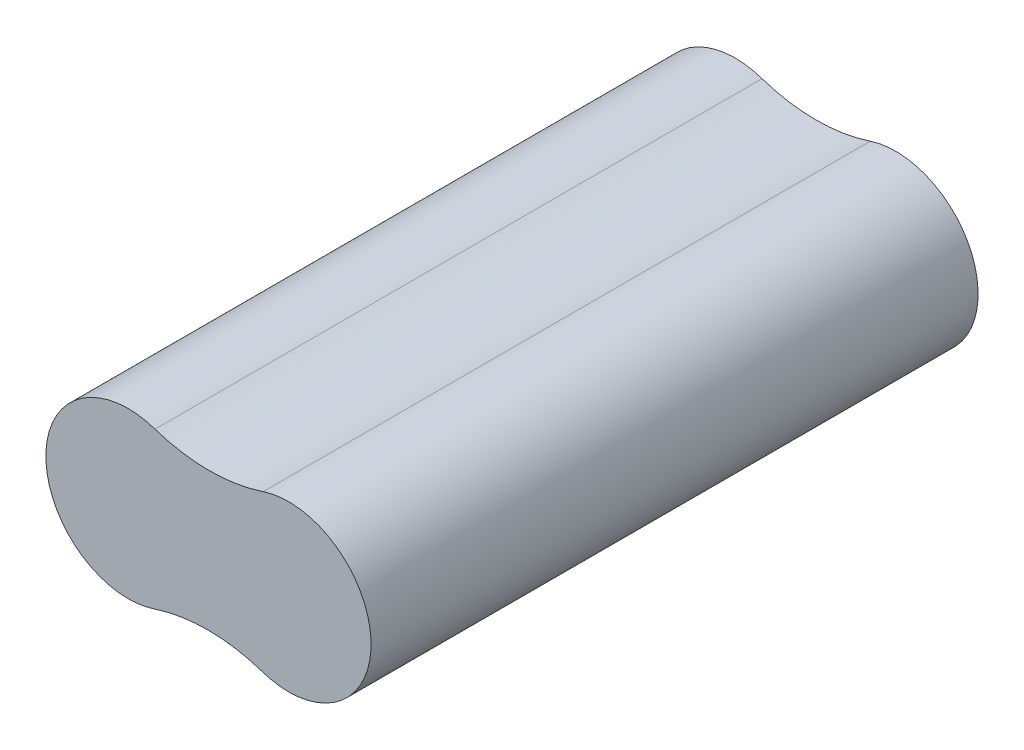
ISO-10303-21;
HEADER;
FILE_DESCRIPTION(('STEP AP214'),'2;1');
FILE_NAME('part.step','',(''),(''),'','','');
FILE_SCHEMA(('AUTOMOTIVE_DESIGN { 1 0 10303 214 1 1 1 1 }'));
ENDSEC;
DATA;
#1=APPLICATION_CONTEXT('core data for automotive mechanical design processes');
#2=APPLICATION_PROTOCOL_DEFINITION('international standard','automotive_design',2000,#1);
#3=PRODUCT_CONTEXT('',#1,'mechanical');
#4=PRODUCT('Part','Part','',(#3));
#5=PRODUCT_RELATED_PRODUCT_CATEGORY('part','',(#4));
#6=PRODUCT_DEFINITION_FORMATION('','',#4);
#7=PRODUCT_DEFINITION_CONTEXT('part definition',#1,'design');
#8=PRODUCT_DEFINITION('design','',#6,#7);
#9=PRODUCT_DEFINITION_SHAPE('','',#8);
#10=(LENGTH_UNIT() NAMED_UNIT(*) SI_UNIT(.MILLI.,.METRE.));
#11=(NAMED_UNIT(*) PLANE_ANGLE_UNIT() SI_UNIT($,.RADIAN.));
#12=(NAMED_UNIT(*) SI_UNIT($,.STERADIAN.) SOLID_ANGLE_UNIT());
#13=UNCERTAINTY_MEASURE_WITH_UNIT(LENGTH_MEASURE(1.E-05),#10,'distance_accuracy_value','');
#14=(GEOMETRIC_REPRESENTATION_CONTEXT(3) GLOBAL_UNCERTAINTY_ASSIGNED_CONTEXT((#13)) GLOBAL_UNIT_ASSIGNED_CONTEXT((#10,
#11,#12)) REPRESENTATION_CONTEXT('',''));
#15=CARTESIAN_POINT('',(0.,0.,0.));
#16=DIRECTION('',(0.,0.,1.));
#17=DIRECTION('',(1.,0.,0.));
#18=AXIS2_PLACEMENT_3D('',#15,#16,#17);
#19=CARTESIAN_POINT('',(-9.40883756359702,0.0504062338667864,70.));
#20=DIRECTION('',(0.,0.,-1.));
#21=DIRECTION('',(-1.,0.,0.));
#22=AXIS2_PLACEMENT_3D('',#19,#20,#21);
#23=CYLINDRICAL_SURFACE('',#22,9.50000000000003);
#24=CARTESIAN_POINT('',(-9.40883756359702,0.0504062338667864,0.));
#25=DIRECTION('',(0.,0.,1.));
#26=DIRECTION('',(1.,0.,0.));
#27=AXIS2_PLACEMENT_3D('',#24,#25,#26);
#28=CIRCLE('',#27,9.50000000000003);
#29=CARTESIAN_POINT('',(-6.32226881172392,9.0350093603249,0.));
#30=VERTEX_POINT('',#29);
#31=CARTESIAN_POINT('',(-6.32226881172356,-8.93419689259119,0.));
#32=VERTEX_POINT('',#31);
#33=EDGE_CURVE('E97',#30,#32,#28,.T.);
#34=ORIENTED_EDGE('',*,*,#33,.T.);
#35=DIRECTION('',(0.,0.,-1.));
#36=VECTOR('',#35,1.);
#37=CARTESIAN_POINT('',(-6.32226881172356,-8.93419689259119,70.));
#38=LINE('',#37,#36);
#39=CARTESIAN_POINT('',(-6.32226881172356,-8.93419689259119,70.));
#40=VERTEX_POINT('',#39);
#41=EDGE_CURVE('E11',#40,#32,#38,.T.);
#42=ORIENTED_EDGE('',*,*,#41,.F.);
#43=CARTESIAN_POINT('',(-9.40883756359702,0.0504062338667864,70.));
#44=DIRECTION('',(0.,0.,1.));
#45=DIRECTION('',(1.,0.,0.));
#46=AXIS2_PLACEMENT_3D('',#43,#44,#45);
#47=CIRCLE('',#46,9.50000000000003);
#48=CARTESIAN_POINT('',(-6.32226881172392,9.0350093603249,70.));
#49=VERTEX_POINT('',#48);
#50=EDGE_CURVE('E85',#49,#40,#47,.T.);
#51=ORIENTED_EDGE('',*,*,#50,.F.);
#52=DIRECTION('',(0.,0.,-1.));
#53=VECTOR('',#52,1.);
#54=CARTESIAN_POINT('',(-6.32226881172392,9.0350093603249,70.));
#55=LINE('',#54,#53);
#56=EDGE_CURVE('E93',#49,#30,#55,.T.);
#57=ORIENTED_EDGE('',*,*,#56,.T.);
#58=EDGE_LOOP('',(#34,#42,#51,#57));
#59=FACE_BOUND('',#58,.T.);
#60=ADVANCED_FACE('F34',(#59),#23,.T.);
#61=CARTESIAN_POINT('',(-0.235214054674297,-27.6784899948528,70.));
#62=DIRECTION('',(0.,0.,-1.));
#63=DIRECTION('',(-1.,0.,0.));
#64=AXIS2_PLACEMENT_3D('',#61,#62,#63);
#65=CYLINDRICAL_SURFACE('',#64,19.7078857191432);
#66=CARTESIAN_POINT('',(-0.235214054674297,-27.6784899948528,0.));
#67=DIRECTION('',(0.,0.,-1.));
#68=DIRECTION('',(-1.,0.,0.));
#69=AXIS2_PLACEMENT_3D('',#66,#67,#68);
#70=CIRCLE('',#69,19.7078857191432);
#71=CARTESIAN_POINT('',(6.00492643016067,-8.98460312645831,0.));
#72=VERTEX_POINT('',#71);
#73=EDGE_CURVE('E89',#32,#72,#70,.T.);
#74=ORIENTED_EDGE('',*,*,#73,.T.);
#75=DIRECTION('',(0.,0.,-1.));
#76=VECTOR('',#75,1.);
#77=CARTESIAN_POINT('',(6.00492643016067,-8.98460312645831,70.));
#78=LINE('',#77,#76);
#79=CARTESIAN_POINT('',(6.00492643016067,-8.98460312645831,70.));
#80=VERTEX_POINT('',#79);
#81=EDGE_CURVE('E42',#80,#72,#78,.T.);
#82=ORIENTED_EDGE('',*,*,#81,.F.);
#83=CARTESIAN_POINT('',(-0.235214054674297,-27.6784899948528,70.));
#84=DIRECTION('',(0.,0.,-1.));
#85=DIRECTION('',(-1.,0.,0.));
#86=AXIS2_PLACEMENT_3D('',#83,#84,#85);
#87=CIRCLE('',#86,19.7078857191432);
#88=EDGE_CURVE('E80',#40,#80,#87,.T.);
#89=ORIENTED_EDGE('',*,*,#88,.F.);
#90=ORIENTED_EDGE('',*,*,#41,.T.);
#91=EDGE_LOOP('',(#74,#82,#89,#90));
#92=FACE_BOUND('',#91,.T.);
#93=ADVANCED_FACE('F88',(#92),#65,.F.);
#94=CARTESIAN_POINT('',(9.09149518203315,0.,70.));
#95=DIRECTION('',(0.,0.,-1.));
#96=DIRECTION('',(-1.,0.,0.));
#97=AXIS2_PLACEMENT_3D('',#94,#95,#96);
#98=CYLINDRICAL_SURFACE('',#97,9.5);
#99=CARTESIAN_POINT('',(9.09149518203315,0.,0.));
#100=DIRECTION('',(0.,0.,1.));
#101=DIRECTION('',(1.,0.,0.));
#102=AXIS2_PLACEMENT_3D('',#99,#100,#101);
#103=CIRCLE('',#102,9.5);
#104=CARTESIAN_POINT('',(6.1557489636343,9.03500936032483,0.));
#105=VERTEX_POINT('',#104);
#106=EDGE_CURVE('E67',#72,#105,#103,.T.);
#107=ORIENTED_EDGE('',*,*,#106,.T.);
#108=DIRECTION('',(0.,0.,-1.));
#109=VECTOR('',#108,1.);
#110=CARTESIAN_POINT('',(6.1557489636343,9.03500936032483,70.));
#111=LINE('',#110,#109);
#112=CARTESIAN_POINT('',(6.1557489636343,9.03500936032483,70.));
#113=VERTEX_POINT('',#112);
#114=EDGE_CURVE('E90',#113,#105,#111,.T.);
#115=ORIENTED_EDGE('',*,*,#114,.F.);
#116=CARTESIAN_POINT('',(9.09149518203315,0.,70.));
#117=DIRECTION('',(0.,0.,1.));
#118=DIRECTION('',(1.,0.,0.));
#119=AXIS2_PLACEMENT_3D('',#116,#117,#118);
#120=CIRCLE('',#119,9.5);
#121=EDGE_CURVE('E83',#80,#113,#120,.T.);
#122=ORIENTED_EDGE('',*,*,#121,.F.);
#123=ORIENTED_EDGE('',*,*,#81,.T.);
#124=EDGE_LOOP('',(#107,#115,#122,#123));
#125=FACE_BOUND('',#124,.T.);
#126=ADVANCED_FACE('F91',(#125),#98,.T.);
#127=CARTESIAN_POINT('',(-0.083259924044699,27.7292739251122,70.));
#128=DIRECTION('',(0.,0.,-1.));
#129=DIRECTION('',(-1.,0.,0.));
#130=AXIS2_PLACEMENT_3D('',#127,#128,#129);
#131=CYLINDRICAL_SURFACE('',#130,19.7078857191431);
#132=CARTESIAN_POINT('',(-0.083259924044699,27.7292739251122,0.));
#133=DIRECTION('',(0.,0.,-1.));
#134=DIRECTION('',(1.,0.,0.));
#135=AXIS2_PLACEMENT_3D('',#132,#133,#134);
#136=CIRCLE('',#135,19.7078857191431);
#137=EDGE_CURVE('E73',#105,#30,#136,.T.);
#138=ORIENTED_EDGE('',*,*,#137,.T.);
#139=ORIENTED_EDGE('',*,*,#56,.F.);
#140=CARTESIAN_POINT('',(-0.083259924044699,27.7292739251122,70.));
#141=DIRECTION('',(0.,0.,-1.));
#142=DIRECTION('',(1.,0.,0.));
#143=AXIS2_PLACEMENT_3D('',#140,#141,#142);
#144=CIRCLE('',#143,19.7078857191431);
#145=EDGE_CURVE('E50',#113,#49,#144,.T.);
#146=ORIENTED_EDGE('',*,*,#145,.F.);
#147=ORIENTED_EDGE('',*,*,#114,.T.);
#148=EDGE_LOOP('',(#138,#139,#146,#147));
#149=FACE_BOUND('',#148,.T.);
#150=ADVANCED_FACE('F104',(#149),#131,.F.);
#151=CARTESIAN_POINT('',(-4.82202580913566,-13.814041880493,70.));
#152=DIRECTION('',(0.,0.,1.));
#153=DIRECTION('',(1.,0.,0.));
#154=AXIS2_PLACEMENT_3D('',#151,#152,#153);
#155=PLANE('',#154);
#156=ORIENTED_EDGE('',*,*,#50,.T.);
#157=ORIENTED_EDGE('',*,*,#88,.T.);
#158=ORIENTED_EDGE('',*,*,#121,.T.);
#159=ORIENTED_EDGE('',*,*,#145,.T.);
#160=EDGE_LOOP('',(#156,#157,#158,#159));
#161=FACE_BOUND('',#160,.T.);
#162=ADVANCED_FACE('F81',(#161),#155,.T.);
#163=CARTESIAN_POINT('',(-4.82202580913566,-13.814041880493,0.));
#164=DIRECTION('',(0.,0.,1.));
#165=DIRECTION('',(1.,0.,0.));
#166=AXIS2_PLACEMENT_3D('',#163,#164,#165);
#167=PLANE('',#166);
#168=ORIENTED_EDGE('',*,*,#33,.F.);
#169=ORIENTED_EDGE('',*,*,#137,.F.);
#170=ORIENTED_EDGE('',*,*,#106,.F.);
#171=ORIENTED_EDGE('',*,*,#73,.F.);
#172=EDGE_LOOP('',(#168,#169,#170,#171));
#173=FACE_BOUND('',#172,.T.);
#174=ADVANCED_FACE('F107',(#173),#167,.F.);
#175=CLOSED_SHELL('',(#60,#93,#126,#150,#162,#174));
#176=MANIFOLD_SOLID_BREP('B2',#175);
#177=ADVANCED_BREP_SHAPE_REPRESENTATION('',(#18,#176),#14);
#178=SHAPE_DEFINITION_REPRESENTATION(#9,#177);
ENDSEC;
END-ISO-10303-21;
